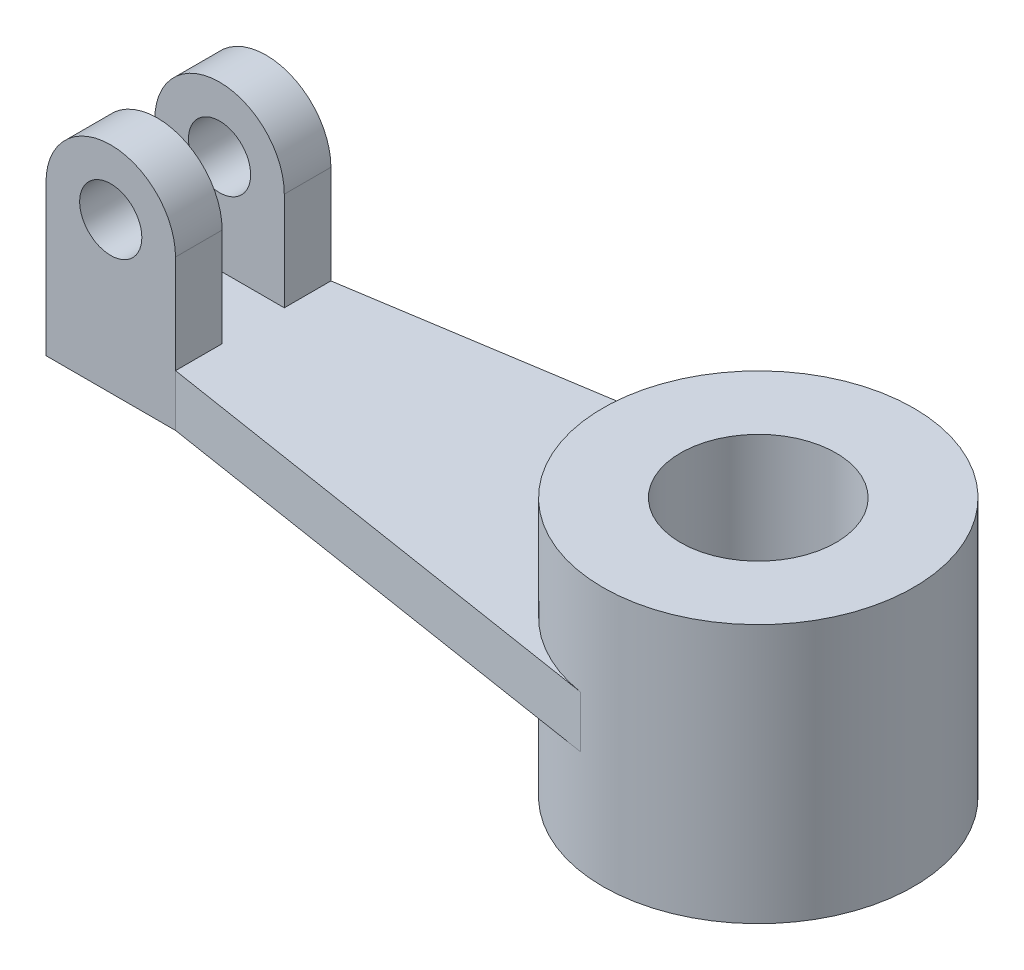
ISO-10303-21;
HEADER;
FILE_DESCRIPTION(('STEP AP214'),'2;1');
FILE_NAME('part.step','',(''),(''),'','','');
FILE_SCHEMA(('AUTOMOTIVE_DESIGN { 1 0 10303 214 1 1 1 1 }'));
ENDSEC;
DATA;
#1=APPLICATION_CONTEXT('core data for automotive mechanical design processes');
#2=APPLICATION_PROTOCOL_DEFINITION('international standard','automotive_design',2000,#1);
#3=PRODUCT_CONTEXT('',#1,'mechanical');
#4=PRODUCT('Part','Part','',(#3));
#5=PRODUCT_RELATED_PRODUCT_CATEGORY('part','',(#4));
#6=PRODUCT_DEFINITION_FORMATION('','',#4);
#7=PRODUCT_DEFINITION_CONTEXT('part definition',#1,'design');
#8=PRODUCT_DEFINITION('design','',#6,#7);
#9=PRODUCT_DEFINITION_SHAPE('','',#8);
#10=(LENGTH_UNIT() NAMED_UNIT(*) SI_UNIT(.MILLI.,.METRE.));
#11=(NAMED_UNIT(*) PLANE_ANGLE_UNIT() SI_UNIT($,.RADIAN.));
#12=(NAMED_UNIT(*) SI_UNIT($,.STERADIAN.) SOLID_ANGLE_UNIT());
#13=UNCERTAINTY_MEASURE_WITH_UNIT(LENGTH_MEASURE(1.E-05),#10,'distance_accuracy_value','');
#14=(GEOMETRIC_REPRESENTATION_CONTEXT(3) GLOBAL_UNCERTAINTY_ASSIGNED_CONTEXT((#13)) GLOBAL_UNIT_ASSIGNED_CONTEXT((#10,
#11,#12)) REPRESENTATION_CONTEXT('',''));
#15=CARTESIAN_POINT('',(0.,0.,0.));
#16=DIRECTION('',(0.,0.,1.));
#17=DIRECTION('',(1.,0.,0.));
#18=AXIS2_PLACEMENT_3D('',#15,#16,#17);
#19=CARTESIAN_POINT('',(0.,5.,0.));
#20=DIRECTION('',(0.,1.,0.));
#21=DIRECTION('',(0.,0.,1.));
#22=AXIS2_PLACEMENT_3D('',#19,#20,#21);
#23=PLANE('',#22);
#24=DIRECTION('',(0.,0.,-1.));
#25=VECTOR('',#24,1.);
#26=CARTESIAN_POINT('',(-97.5,5.,-6.));
#27=LINE('',#26,#25);
#28=CARTESIAN_POINT('',(-97.5,5.,-6.));
#29=VERTEX_POINT('',#28);
#30=CARTESIAN_POINT('',(-97.5,5.,-15.));
#31=VERTEX_POINT('',#30);
#32=EDGE_CURVE('E129',#29,#31,#27,.T.);
#33=ORIENTED_EDGE('',*,*,#32,.F.);
#34=DIRECTION('',(-1.,0.,0.));
#35=VECTOR('',#34,1.);
#36=CARTESIAN_POINT('',(0.,5.,-6.));
#37=LINE('',#36,#35);
#38=CARTESIAN_POINT('',(-122.5,5.,-6.));
#39=VERTEX_POINT('',#38);
#40=EDGE_CURVE('E117',#29,#39,#37,.T.);
#41=ORIENTED_EDGE('',*,*,#40,.T.);
#42=DIRECTION('',(0.,0.,-1.));
#43=VECTOR('',#42,1.);
#44=CARTESIAN_POINT('',(-122.5,5.,0.));
#45=LINE('',#44,#43);
#46=CARTESIAN_POINT('',(-122.5,5.,6.));
#47=VERTEX_POINT('',#46);
#48=EDGE_CURVE('E55',#47,#39,#45,.T.);
#49=ORIENTED_EDGE('',*,*,#48,.F.);
#50=DIRECTION('',(-1.,0.,0.));
#51=VECTOR('',#50,1.);
#52=CARTESIAN_POINT('',(0.,5.,6.));
#53=LINE('',#52,#51);
#54=CARTESIAN_POINT('',(-97.5,5.,6.));
#55=VERTEX_POINT('',#54);
#56=EDGE_CURVE('E50',#55,#47,#53,.T.);
#57=ORIENTED_EDGE('',*,*,#56,.F.);
#58=DIRECTION('',(0.,0.,1.));
#59=VECTOR('',#58,1.);
#60=CARTESIAN_POINT('',(-97.5,5.,6.));
#61=LINE('',#60,#59);
#62=CARTESIAN_POINT('',(-97.5,5.,15.));
#63=VERTEX_POINT('',#62);
#64=EDGE_CURVE('E168',#55,#63,#61,.T.);
#65=ORIENTED_EDGE('',*,*,#64,.T.);
#66=DIRECTION('',(0.987800769478854,0.,0.155722958541715));
#67=VECTOR('',#66,1.);
#68=CARTESIAN_POINT('',(-4.67168875625144,5.,29.6340230843656));
#69=LINE('',#68,#67);
#70=CARTESIAN_POINT('',(-4.67168875625144,5.,29.6340230843656));
#71=VERTEX_POINT('',#70);
#72=EDGE_CURVE('E176',#63,#71,#69,.T.);
#73=ORIENTED_EDGE('',*,*,#72,.T.);
#74=CARTESIAN_POINT('',(0.,5.,0.));
#75=DIRECTION('',(0.,1.,0.));
#76=DIRECTION('',(0.,0.,1.));
#77=AXIS2_PLACEMENT_3D('',#74,#75,#76);
#78=CIRCLE('',#77,30.);
#79=CARTESIAN_POINT('',(-4.67168875625144,5.,-29.6340230843656));
#80=VERTEX_POINT('',#79);
#81=EDGE_CURVE('E180',#80,#71,#78,.T.);
#82=ORIENTED_EDGE('',*,*,#81,.F.);
#83=DIRECTION('',(0.987800769478854,0.,-0.155722958541715));
#84=VECTOR('',#83,1.);
#85=CARTESIAN_POINT('',(-4.67168875625144,5.,-29.6340230843656));
#86=LINE('',#85,#84);
#87=EDGE_CURVE('E138',#31,#80,#86,.T.);
#88=ORIENTED_EDGE('',*,*,#87,.F.);
#89=EDGE_LOOP('',(#33,#41,#49,#57,#65,#73,#82,#88));
#90=FACE_BOUND('',#89,.T.);
#91=ADVANCED_FACE('F35',(#90),#23,.T.);
#92=CARTESIAN_POINT('',(0.,25.,0.));
#93=DIRECTION('',(0.,1.,0.));
#94=DIRECTION('',(0.,0.,1.));
#95=AXIS2_PLACEMENT_3D('',#92,#93,#94);
#96=PLANE('',#95);
#97=CARTESIAN_POINT('',(0.,25.,0.));
#98=DIRECTION('',(0.,1.,0.));
#99=DIRECTION('',(0.,0.,1.));
#100=AXIS2_PLACEMENT_3D('',#97,#98,#99);
#101=CIRCLE('',#100,30.);
#102=CARTESIAN_POINT('',(0.,25.,30.));
#103=VERTEX_POINT('',#102);
#104=EDGE_CURVE('E11',#103,#103,#101,.T.);
#105=ORIENTED_EDGE('',*,*,#104,.T.);
#106=EDGE_LOOP('',(#105));
#107=FACE_BOUND('',#106,.T.);
#108=CARTESIAN_POINT('',(0.,25.,0.));
#109=DIRECTION('',(0.,1.,0.));
#110=DIRECTION('',(0.,0.,1.));
#111=AXIS2_PLACEMENT_3D('',#108,#109,#110);
#112=CIRCLE('',#111,15.);
#113=CARTESIAN_POINT('',(0.,25.,15.));
#114=VERTEX_POINT('',#113);
#115=EDGE_CURVE('E213',#114,#114,#112,.T.);
#116=ORIENTED_EDGE('',*,*,#115,.F.);
#117=EDGE_LOOP('',(#116));
#118=FACE_BOUND('',#117,.T.);
#119=ADVANCED_FACE('F236',(#107,#118),#96,.T.);
#120=CARTESIAN_POINT('',(0.,-25.,0.));
#121=DIRECTION('',(0.,1.,0.));
#122=DIRECTION('',(0.,0.,1.));
#123=AXIS2_PLACEMENT_3D('',#120,#121,#122);
#124=PLANE('',#123);
#125=CARTESIAN_POINT('',(0.,-25.,0.));
#126=DIRECTION('',(0.,1.,0.));
#127=DIRECTION('',(0.,0.,1.));
#128=AXIS2_PLACEMENT_3D('',#125,#126,#127);
#129=CIRCLE('',#128,30.);
#130=CARTESIAN_POINT('',(0.,-25.,30.));
#131=VERTEX_POINT('',#130);
#132=EDGE_CURVE('E39',#131,#131,#129,.T.);
#133=ORIENTED_EDGE('',*,*,#132,.F.);
#134=EDGE_LOOP('',(#133));
#135=FACE_BOUND('',#134,.T.);
#136=CARTESIAN_POINT('',(0.,-25.,0.));
#137=DIRECTION('',(0.,1.,0.));
#138=DIRECTION('',(0.,0.,1.));
#139=AXIS2_PLACEMENT_3D('',#136,#137,#138);
#140=CIRCLE('',#139,15.);
#141=CARTESIAN_POINT('',(0.,-25.,15.));
#142=VERTEX_POINT('',#141);
#143=EDGE_CURVE('E212',#142,#142,#140,.T.);
#144=ORIENTED_EDGE('',*,*,#143,.T.);
#145=EDGE_LOOP('',(#144));
#146=FACE_BOUND('',#145,.T.);
#147=ADVANCED_FACE('F219',(#135,#146),#124,.F.);
#148=CARTESIAN_POINT('',(0.,25.,0.));
#149=DIRECTION('',(0.,-1.,0.));
#150=DIRECTION('',(0.,0.,-1.));
#151=AXIS2_PLACEMENT_3D('',#148,#149,#150);
#152=CYLINDRICAL_SURFACE('',#151,30.);
#153=DIRECTION('',(0.,-1.,0.));
#154=VECTOR('',#153,1.);
#155=CARTESIAN_POINT('',(-4.67168875625145,5.,-29.6340230843656));
#156=LINE('',#155,#154);
#157=CARTESIAN_POINT('',(-4.67168875625144,-5.,-29.6340230843656));
#158=VERTEX_POINT('',#157);
#159=EDGE_CURVE('E202',#80,#158,#156,.T.);
#160=ORIENTED_EDGE('',*,*,#159,.F.);
#161=ORIENTED_EDGE('',*,*,#81,.T.);
#162=DIRECTION('',(0.,-1.,0.));
#163=VECTOR('',#162,1.);
#164=CARTESIAN_POINT('',(-4.67168875625144,5.,29.6340230843656));
#165=LINE('',#164,#163);
#166=CARTESIAN_POINT('',(-4.67168875625144,-5.,29.6340230843656));
#167=VERTEX_POINT('',#166);
#168=EDGE_CURVE('E205',#71,#167,#165,.T.);
#169=ORIENTED_EDGE('',*,*,#168,.T.);
#170=CARTESIAN_POINT('',(0.,-5.,0.));
#171=DIRECTION('',(0.,1.,0.));
#172=DIRECTION('',(0.,0.,1.));
#173=AXIS2_PLACEMENT_3D('',#170,#171,#172);
#174=CIRCLE('',#173,30.);
#175=EDGE_CURVE('E191',#158,#167,#174,.T.);
#176=ORIENTED_EDGE('',*,*,#175,.F.);
#177=EDGE_LOOP('',(#160,#161,#169,#176));
#178=FACE_BOUND('',#177,.T.);
#179=ORIENTED_EDGE('',*,*,#104,.F.);
#180=EDGE_LOOP('',(#179));
#181=FACE_BOUND('',#180,.T.);
#182=ORIENTED_EDGE('',*,*,#132,.T.);
#183=EDGE_LOOP('',(#182));
#184=FACE_BOUND('',#183,.T.);
#185=ADVANCED_FACE('F37',(#178,#181,#184),#152,.T.);
#186=CARTESIAN_POINT('',(0.,25.,0.));
#187=DIRECTION('',(0.,-1.,0.));
#188=DIRECTION('',(0.,0.,-1.));
#189=AXIS2_PLACEMENT_3D('',#186,#187,#188);
#190=CYLINDRICAL_SURFACE('',#189,15.);
#191=ORIENTED_EDGE('',*,*,#115,.T.);
#192=EDGE_LOOP('',(#191));
#193=FACE_BOUND('',#192,.T.);
#194=ORIENTED_EDGE('',*,*,#143,.F.);
#195=EDGE_LOOP('',(#194));
#196=FACE_BOUND('',#195,.T.);
#197=ADVANCED_FACE('F221',(#193,#196),#190,.F.);
#198=CARTESIAN_POINT('',(-122.5,5.,0.));
#199=DIRECTION('',(-1.,0.,0.));
#200=DIRECTION('',(0.,0.,1.));
#201=AXIS2_PLACEMENT_3D('',#198,#199,#200);
#202=PLANE('',#201);
#203=DIRECTION('',(0.,0.,-1.));
#204=VECTOR('',#203,1.);
#205=CARTESIAN_POINT('',(-122.5,-5.,0.));
#206=LINE('',#205,#204);
#207=CARTESIAN_POINT('',(-122.5,-5.,15.));
#208=VERTEX_POINT('',#207);
#209=CARTESIAN_POINT('',(-122.5,-5.,-15.));
#210=VERTEX_POINT('',#209);
#211=EDGE_CURVE('E170',#208,#210,#206,.T.);
#212=ORIENTED_EDGE('',*,*,#211,.F.);
#213=DIRECTION('',(0.,-1.,0.));
#214=VECTOR('',#213,1.);
#215=CARTESIAN_POINT('',(-122.5,5.,15.));
#216=LINE('',#215,#214);
#217=CARTESIAN_POINT('',(-122.5,24.,15.));
#218=VERTEX_POINT('',#217);
#219=EDGE_CURVE('E210',#218,#208,#216,.T.);
#220=ORIENTED_EDGE('',*,*,#219,.F.);
#221=DIRECTION('',(0.,0.,1.));
#222=VECTOR('',#221,1.);
#223=CARTESIAN_POINT('',(-122.5,24.,6.));
#224=LINE('',#223,#222);
#225=CARTESIAN_POINT('',(-122.5,24.,6.));
#226=VERTEX_POINT('',#225);
#227=EDGE_CURVE('E171',#226,#218,#224,.T.);
#228=ORIENTED_EDGE('',*,*,#227,.F.);
#229=DIRECTION('',(0.,1.,0.));
#230=VECTOR('',#229,1.);
#231=CARTESIAN_POINT('',(-122.5,0.,6.));
#232=LINE('',#231,#230);
#233=EDGE_CURVE('E156',#47,#226,#232,.T.);
#234=ORIENTED_EDGE('',*,*,#233,.F.);
#235=ORIENTED_EDGE('',*,*,#48,.T.);
#236=DIRECTION('',(0.,1.,0.));
#237=VECTOR('',#236,1.);
#238=CARTESIAN_POINT('',(-122.5,0.,-6.));
#239=LINE('',#238,#237);
#240=CARTESIAN_POINT('',(-122.5,24.,-6.));
#241=VERTEX_POINT('',#240);
#242=EDGE_CURVE('E122',#39,#241,#239,.T.);
#243=ORIENTED_EDGE('',*,*,#242,.T.);
#244=DIRECTION('',(0.,0.,-1.));
#245=VECTOR('',#244,1.);
#246=CARTESIAN_POINT('',(-122.5,24.,-6.));
#247=LINE('',#246,#245);
#248=CARTESIAN_POINT('',(-122.5,24.,-15.));
#249=VERTEX_POINT('',#248);
#250=EDGE_CURVE('E139',#241,#249,#247,.T.);
#251=ORIENTED_EDGE('',*,*,#250,.T.);
#252=DIRECTION('',(0.,-1.,0.));
#253=VECTOR('',#252,1.);
#254=CARTESIAN_POINT('',(-122.5,5.,-15.));
#255=LINE('',#254,#253);
#256=EDGE_CURVE('E183',#249,#210,#255,.T.);
#257=ORIENTED_EDGE('',*,*,#256,.T.);
#258=EDGE_LOOP('',(#212,#220,#228,#234,#235,#243,#251,#257));
#259=FACE_BOUND('',#258,.T.);
#260=ADVANCED_FACE('F223',(#259),#202,.T.);
#261=CARTESIAN_POINT('',(0.,5.,15.));
#262=DIRECTION('',(0.,0.,-1.));
#263=DIRECTION('',(-1.,0.,0.));
#264=AXIS2_PLACEMENT_3D('',#261,#262,#263);
#265=PLANE('',#264);
#266=DIRECTION('',(1.,0.,0.));
#267=VECTOR('',#266,1.);
#268=CARTESIAN_POINT('',(0.,-5.,15.));
#269=LINE('',#268,#267);
#270=CARTESIAN_POINT('',(-97.5,-5.,15.));
#271=VERTEX_POINT('',#270);
#272=EDGE_CURVE('E186',#208,#271,#269,.T.);
#273=ORIENTED_EDGE('',*,*,#272,.T.);
#274=DIRECTION('',(0.,-1.,0.));
#275=VECTOR('',#274,1.);
#276=CARTESIAN_POINT('',(-97.5,5.,15.));
#277=LINE('',#276,#275);
#278=EDGE_CURVE('E207',#63,#271,#277,.T.);
#279=ORIENTED_EDGE('',*,*,#278,.F.);
#280=DIRECTION('',(0.,-1.,0.));
#281=VECTOR('',#280,1.);
#282=CARTESIAN_POINT('',(-97.5,0.,15.));
#283=LINE('',#282,#281);
#284=CARTESIAN_POINT('',(-97.5,24.,15.));
#285=VERTEX_POINT('',#284);
#286=EDGE_CURVE('E163',#285,#63,#283,.T.);
#287=ORIENTED_EDGE('',*,*,#286,.F.);
#288=CARTESIAN_POINT('',(-110.,24.,15.));
#289=DIRECTION('',(0.,0.,1.));
#290=DIRECTION('',(1.,0.,0.));
#291=AXIS2_PLACEMENT_3D('',#288,#289,#290);
#292=CIRCLE('',#291,12.5);
#293=EDGE_CURVE('E151',#285,#218,#292,.T.);
#294=ORIENTED_EDGE('',*,*,#293,.T.);
#295=ORIENTED_EDGE('',*,*,#219,.T.);
#296=EDGE_LOOP('',(#273,#279,#287,#294,#295));
#297=FACE_BOUND('',#296,.T.);
#298=CARTESIAN_POINT('',(-110.,24.,15.));
#299=DIRECTION('',(0.,0.,1.));
#300=DIRECTION('',(1.,0.,0.));
#301=AXIS2_PLACEMENT_3D('',#298,#299,#300);
#302=CIRCLE('',#301,6.);
#303=CARTESIAN_POINT('',(-104.,24.,15.));
#304=VERTEX_POINT('',#303);
#305=EDGE_CURVE('E160',#304,#304,#302,.T.);
#306=ORIENTED_EDGE('',*,*,#305,.F.);
#307=EDGE_LOOP('',(#306));
#308=FACE_BOUND('',#307,.T.);
#309=ADVANCED_FACE('F230',(#297,#308),#265,.F.);
#310=CARTESIAN_POINT('',(-4.67168875625144,5.,29.6340230843656));
#311=DIRECTION('',(0.155722958541715,0.,-0.987800769478854));
#312=DIRECTION('',(-0.987800769478854,0.,-0.155722958541715));
#313=AXIS2_PLACEMENT_3D('',#310,#311,#312);
#314=PLANE('',#313);
#315=DIRECTION('',(0.987800769478854,0.,0.155722958541715));
#316=VECTOR('',#315,1.);
#317=CARTESIAN_POINT('',(-4.67168875625144,-5.,29.6340230843656));
#318=LINE('',#317,#316);
#319=EDGE_CURVE('E188',#271,#167,#318,.T.);
#320=ORIENTED_EDGE('',*,*,#319,.T.);
#321=ORIENTED_EDGE('',*,*,#168,.F.);
#322=ORIENTED_EDGE('',*,*,#72,.F.);
#323=ORIENTED_EDGE('',*,*,#278,.T.);
#324=EDGE_LOOP('',(#320,#321,#322,#323));
#325=FACE_BOUND('',#324,.T.);
#326=ADVANCED_FACE('F258',(#325),#314,.F.);
#327=CARTESIAN_POINT('',(-4.67168875625144,5.,-29.6340230843656));
#328=DIRECTION('',(-0.155722958541715,0.,-0.987800769478854));
#329=DIRECTION('',(-0.987800769478854,0.,0.155722958541715));
#330=AXIS2_PLACEMENT_3D('',#327,#328,#329);
#331=PLANE('',#330);
#332=DIRECTION('',(0.987800769478854,0.,-0.155722958541715));
#333=VECTOR('',#332,1.);
#334=CARTESIAN_POINT('',(-4.67168875625144,-5.,-29.6340230843656));
#335=LINE('',#334,#333);
#336=CARTESIAN_POINT('',(-97.5,-5.,-15.));
#337=VERTEX_POINT('',#336);
#338=EDGE_CURVE('E194',#337,#158,#335,.T.);
#339=ORIENTED_EDGE('',*,*,#338,.F.);
#340=DIRECTION('',(0.,-1.,0.));
#341=VECTOR('',#340,1.);
#342=CARTESIAN_POINT('',(-97.5,5.,-15.));
#343=LINE('',#342,#341);
#344=EDGE_CURVE('E200',#31,#337,#343,.T.);
#345=ORIENTED_EDGE('',*,*,#344,.F.);
#346=ORIENTED_EDGE('',*,*,#87,.T.);
#347=ORIENTED_EDGE('',*,*,#159,.T.);
#348=EDGE_LOOP('',(#339,#345,#346,#347));
#349=FACE_BOUND('',#348,.T.);
#350=ADVANCED_FACE('F254',(#349),#331,.T.);
#351=CARTESIAN_POINT('',(0.,5.,-15.));
#352=DIRECTION('',(0.,0.,-1.));
#353=DIRECTION('',(-1.,0.,0.));
#354=AXIS2_PLACEMENT_3D('',#351,#352,#353);
#355=PLANE('',#354);
#356=DIRECTION('',(1.,0.,0.));
#357=VECTOR('',#356,1.);
#358=CARTESIAN_POINT('',(0.,-5.,-15.));
#359=LINE('',#358,#357);
#360=EDGE_CURVE('E177',#210,#337,#359,.T.);
#361=ORIENTED_EDGE('',*,*,#360,.F.);
#362=ORIENTED_EDGE('',*,*,#256,.F.);
#363=CARTESIAN_POINT('',(-110.,24.,-15.));
#364=DIRECTION('',(0.,0.,1.));
#365=DIRECTION('',(1.,0.,0.));
#366=AXIS2_PLACEMENT_3D('',#363,#364,#365);
#367=CIRCLE('',#366,12.5);
#368=CARTESIAN_POINT('',(-97.5,24.,-15.));
#369=VERTEX_POINT('',#368);
#370=EDGE_CURVE('E303',#369,#249,#367,.T.);
#371=ORIENTED_EDGE('',*,*,#370,.F.);
#372=DIRECTION('',(0.,-1.,0.));
#373=VECTOR('',#372,1.);
#374=CARTESIAN_POINT('',(-97.5,0.,-15.));
#375=LINE('',#374,#373);
#376=EDGE_CURVE('E301',#369,#31,#375,.T.);
#377=ORIENTED_EDGE('',*,*,#376,.T.);
#378=ORIENTED_EDGE('',*,*,#344,.T.);
#379=EDGE_LOOP('',(#361,#362,#371,#377,#378));
#380=FACE_BOUND('',#379,.T.);
#381=CARTESIAN_POINT('',(-110.,24.,-15.));
#382=DIRECTION('',(0.,0.,1.));
#383=DIRECTION('',(1.,0.,0.));
#384=AXIS2_PLACEMENT_3D('',#381,#382,#383);
#385=CIRCLE('',#384,6.);
#386=CARTESIAN_POINT('',(-104.,24.,-15.));
#387=VERTEX_POINT('',#386);
#388=EDGE_CURVE('E304',#387,#387,#385,.T.);
#389=ORIENTED_EDGE('',*,*,#388,.T.);
#390=EDGE_LOOP('',(#389));
#391=FACE_BOUND('',#390,.T.);
#392=ADVANCED_FACE('F250',(#380,#391),#355,.T.);
#393=CARTESIAN_POINT('',(0.,-5.,0.));
#394=DIRECTION('',(0.,1.,0.));
#395=DIRECTION('',(0.,0.,1.));
#396=AXIS2_PLACEMENT_3D('',#393,#394,#395);
#397=PLANE('',#396);
#398=ORIENTED_EDGE('',*,*,#211,.T.);
#399=ORIENTED_EDGE('',*,*,#360,.T.);
#400=ORIENTED_EDGE('',*,*,#338,.T.);
#401=ORIENTED_EDGE('',*,*,#175,.T.);
#402=ORIENTED_EDGE('',*,*,#319,.F.);
#403=ORIENTED_EDGE('',*,*,#272,.F.);
#404=EDGE_LOOP('',(#398,#399,#400,#401,#402,#403));
#405=FACE_BOUND('',#404,.T.);
#406=ADVANCED_FACE('F246',(#405),#397,.F.);
#407=CARTESIAN_POINT('',(-97.5,0.,6.));
#408=DIRECTION('',(-1.,0.,0.));
#409=DIRECTION('',(0.,0.,1.));
#410=AXIS2_PLACEMENT_3D('',#407,#408,#409);
#411=PLANE('',#410);
#412=ORIENTED_EDGE('',*,*,#286,.T.);
#413=ORIENTED_EDGE('',*,*,#64,.F.);
#414=DIRECTION('',(0.,-1.,0.));
#415=VECTOR('',#414,1.);
#416=CARTESIAN_POINT('',(-97.5,0.,6.));
#417=LINE('',#416,#415);
#418=CARTESIAN_POINT('',(-97.5,24.,6.));
#419=VERTEX_POINT('',#418);
#420=EDGE_CURVE('E150',#419,#55,#417,.T.);
#421=ORIENTED_EDGE('',*,*,#420,.F.);
#422=DIRECTION('',(0.,0.,1.));
#423=VECTOR('',#422,1.);
#424=CARTESIAN_POINT('',(-97.5,24.,6.));
#425=LINE('',#424,#423);
#426=EDGE_CURVE('E159',#419,#285,#425,.T.);
#427=ORIENTED_EDGE('',*,*,#426,.T.);
#428=EDGE_LOOP('',(#412,#413,#421,#427));
#429=FACE_BOUND('',#428,.T.);
#430=ADVANCED_FACE('F249',(#429),#411,.F.);
#431=CARTESIAN_POINT('',(-110.,24.,6.));
#432=DIRECTION('',(0.,0.,1.));
#433=DIRECTION('',(1.,0.,0.));
#434=AXIS2_PLACEMENT_3D('',#431,#432,#433);
#435=CYLINDRICAL_SURFACE('',#434,6.);
#436=CARTESIAN_POINT('',(-110.,24.,6.));
#437=DIRECTION('',(0.,0.,1.));
#438=DIRECTION('',(1.,0.,0.));
#439=AXIS2_PLACEMENT_3D('',#436,#437,#438);
#440=CIRCLE('',#439,6.);
#441=CARTESIAN_POINT('',(-104.,24.,6.));
#442=VERTEX_POINT('',#441);
#443=EDGE_CURVE('E147',#442,#442,#440,.T.);
#444=ORIENTED_EDGE('',*,*,#443,.F.);
#445=EDGE_LOOP('',(#444));
#446=FACE_BOUND('',#445,.T.);
#447=ORIENTED_EDGE('',*,*,#305,.T.);
#448=EDGE_LOOP('',(#447));
#449=FACE_BOUND('',#448,.T.);
#450=ADVANCED_FACE('F244',(#446,#449),#435,.F.);
#451=CARTESIAN_POINT('',(-110.,24.,6.));
#452=DIRECTION('',(0.,0.,1.));
#453=DIRECTION('',(1.,0.,0.));
#454=AXIS2_PLACEMENT_3D('',#451,#452,#453);
#455=CYLINDRICAL_SURFACE('',#454,12.5);
#456=ORIENTED_EDGE('',*,*,#293,.F.);
#457=ORIENTED_EDGE('',*,*,#426,.F.);
#458=CARTESIAN_POINT('',(-110.,24.,6.));
#459=DIRECTION('',(0.,0.,1.));
#460=DIRECTION('',(1.,0.,0.));
#461=AXIS2_PLACEMENT_3D('',#458,#459,#460);
#462=CIRCLE('',#461,12.5);
#463=EDGE_CURVE('E153',#419,#226,#462,.T.);
#464=ORIENTED_EDGE('',*,*,#463,.T.);
#465=ORIENTED_EDGE('',*,*,#227,.T.);
#466=EDGE_LOOP('',(#456,#457,#464,#465));
#467=FACE_BOUND('',#466,.T.);
#468=ADVANCED_FACE('F273',(#467),#455,.T.);
#469=CARTESIAN_POINT('',(0.,0.,6.));
#470=DIRECTION('',(0.,0.,1.));
#471=DIRECTION('',(1.,0.,0.));
#472=AXIS2_PLACEMENT_3D('',#469,#470,#471);
#473=PLANE('',#472);
#474=ORIENTED_EDGE('',*,*,#443,.T.);
#475=EDGE_LOOP('',(#474));
#476=FACE_BOUND('',#475,.T.);
#477=ORIENTED_EDGE('',*,*,#420,.T.);
#478=ORIENTED_EDGE('',*,*,#56,.T.);
#479=ORIENTED_EDGE('',*,*,#233,.T.);
#480=ORIENTED_EDGE('',*,*,#463,.F.);
#481=EDGE_LOOP('',(#477,#478,#479,#480));
#482=FACE_BOUND('',#481,.T.);
#483=ADVANCED_FACE('F279',(#476,#482),#473,.F.);
#484=CARTESIAN_POINT('',(-97.5,0.,-6.));
#485=DIRECTION('',(1.,0.,0.));
#486=DIRECTION('',(0.,0.,-1.));
#487=AXIS2_PLACEMENT_3D('',#484,#485,#486);
#488=PLANE('',#487);
#489=ORIENTED_EDGE('',*,*,#376,.F.);
#490=DIRECTION('',(0.,0.,-1.));
#491=VECTOR('',#490,1.);
#492=CARTESIAN_POINT('',(-97.5,24.,-6.));
#493=LINE('',#492,#491);
#494=CARTESIAN_POINT('',(-97.5,24.,-6.));
#495=VERTEX_POINT('',#494);
#496=EDGE_CURVE('E131',#495,#369,#493,.T.);
#497=ORIENTED_EDGE('',*,*,#496,.F.);
#498=DIRECTION('',(0.,-1.,0.));
#499=VECTOR('',#498,1.);
#500=CARTESIAN_POINT('',(-97.5,0.,-6.));
#501=LINE('',#500,#499);
#502=EDGE_CURVE('E120',#495,#29,#501,.T.);
#503=ORIENTED_EDGE('',*,*,#502,.T.);
#504=ORIENTED_EDGE('',*,*,#32,.T.);
#505=EDGE_LOOP('',(#489,#497,#503,#504));
#506=FACE_BOUND('',#505,.T.);
#507=ADVANCED_FACE('F128',(#506),#488,.T.);
#508=CARTESIAN_POINT('',(-110.,24.,-6.));
#509=DIRECTION('',(0.,0.,-1.));
#510=DIRECTION('',(-1.,0.,0.));
#511=AXIS2_PLACEMENT_3D('',#508,#509,#510);
#512=CYLINDRICAL_SURFACE('',#511,12.5);
#513=ORIENTED_EDGE('',*,*,#370,.T.);
#514=ORIENTED_EDGE('',*,*,#250,.F.);
#515=CARTESIAN_POINT('',(-110.,24.,-6.));
#516=DIRECTION('',(0.,0.,1.));
#517=DIRECTION('',(1.,0.,0.));
#518=AXIS2_PLACEMENT_3D('',#515,#516,#517);
#519=CIRCLE('',#518,12.5);
#520=EDGE_CURVE('E140',#495,#241,#519,.T.);
#521=ORIENTED_EDGE('',*,*,#520,.F.);
#522=ORIENTED_EDGE('',*,*,#496,.T.);
#523=EDGE_LOOP('',(#513,#514,#521,#522));
#524=FACE_BOUND('',#523,.T.);
#525=ADVANCED_FACE('F310',(#524),#512,.T.);
#526=CARTESIAN_POINT('',(-110.,24.,-6.));
#527=DIRECTION('',(0.,0.,-1.));
#528=DIRECTION('',(-1.,0.,0.));
#529=AXIS2_PLACEMENT_3D('',#526,#527,#528);
#530=CYLINDRICAL_SURFACE('',#529,6.);
#531=CARTESIAN_POINT('',(-110.,24.,-6.));
#532=DIRECTION('',(0.,0.,1.));
#533=DIRECTION('',(1.,0.,0.));
#534=AXIS2_PLACEMENT_3D('',#531,#532,#533);
#535=CIRCLE('',#534,6.);
#536=CARTESIAN_POINT('',(-104.,24.,-6.));
#537=VERTEX_POINT('',#536);
#538=EDGE_CURVE('E133',#537,#537,#535,.T.);
#539=ORIENTED_EDGE('',*,*,#538,.T.);
#540=EDGE_LOOP('',(#539));
#541=FACE_BOUND('',#540,.T.);
#542=ORIENTED_EDGE('',*,*,#388,.F.);
#543=EDGE_LOOP('',(#542));
#544=FACE_BOUND('',#543,.T.);
#545=ADVANCED_FACE('F317',(#541,#544),#530,.F.);
#546=CARTESIAN_POINT('',(0.,0.,-6.));
#547=DIRECTION('',(0.,0.,-1.));
#548=DIRECTION('',(1.,0.,0.));
#549=AXIS2_PLACEMENT_3D('',#546,#547,#548);
#550=PLANE('',#549);
#551=ORIENTED_EDGE('',*,*,#538,.F.);
#552=EDGE_LOOP('',(#551));
#553=FACE_BOUND('',#552,.T.);
#554=ORIENTED_EDGE('',*,*,#502,.F.);
#555=ORIENTED_EDGE('',*,*,#520,.T.);
#556=ORIENTED_EDGE('',*,*,#242,.F.);
#557=ORIENTED_EDGE('',*,*,#40,.F.);
#558=EDGE_LOOP('',(#554,#555,#556,#557));
#559=FACE_BOUND('',#558,.T.);
#560=ADVANCED_FACE('F119',(#553,#559),#550,.F.);
#561=CLOSED_SHELL('',(#91,#119,#147,#185,#197,#260,#309,#326,#350,#392,#406,#430,#450,#468,#483,
#507,#525,#545,#560));
#562=MANIFOLD_SOLID_BREP('B2',#561);
#563=ADVANCED_BREP_SHAPE_REPRESENTATION('',(#18,#562),#14);
#564=SHAPE_DEFINITION_REPRESENTATION(#9,#563);
ENDSEC;
END-ISO-10303-21;
